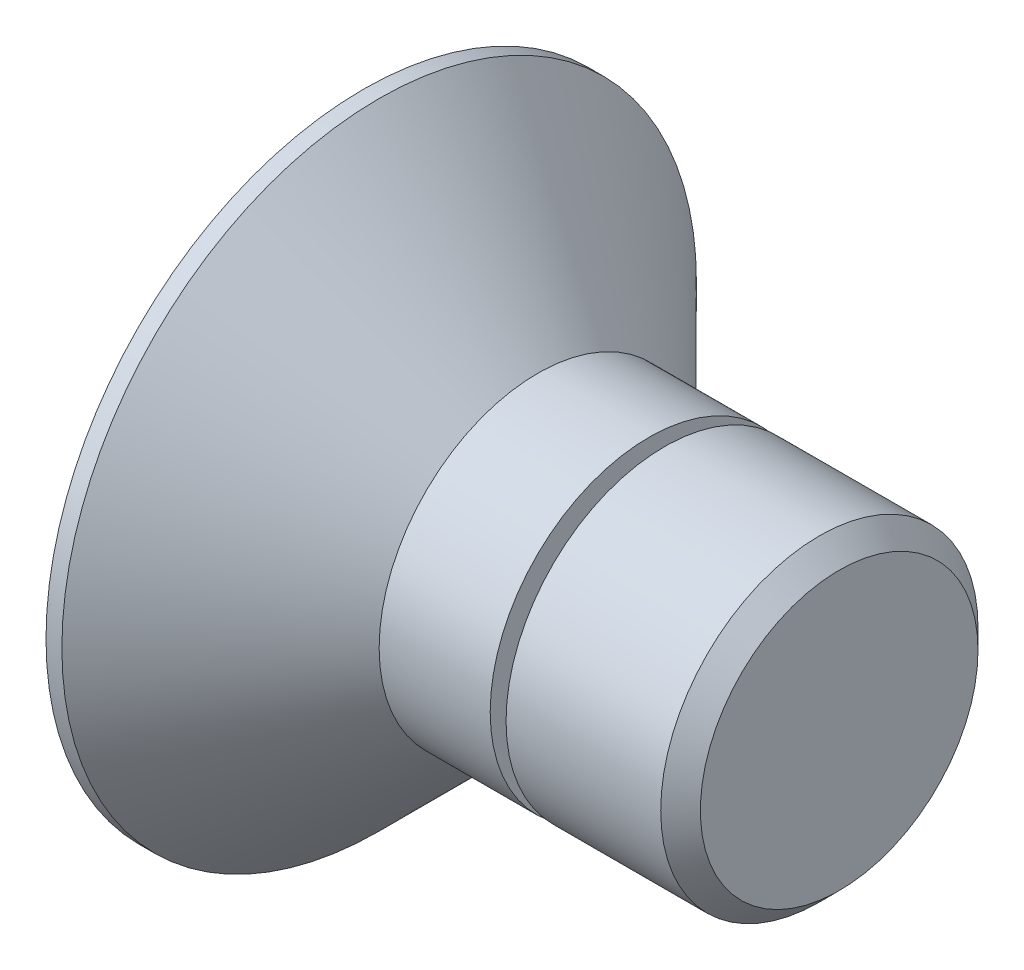
ISO-10303-21;
HEADER;
FILE_DESCRIPTION(('STEP AP214'),'2;1');
FILE_NAME('part.step','',(''),(''),'','','');
FILE_SCHEMA(('AUTOMOTIVE_DESIGN { 1 0 10303 214 1 1 1 1 }'));
ENDSEC;
DATA;
#1=APPLICATION_CONTEXT('core data for automotive mechanical design processes');
#2=APPLICATION_PROTOCOL_DEFINITION('international standard','automotive_design',2000,#1);
#3=PRODUCT_CONTEXT('',#1,'mechanical');
#4=PRODUCT('Part','Part','',(#3));
#5=PRODUCT_RELATED_PRODUCT_CATEGORY('part','',(#4));
#6=PRODUCT_DEFINITION_FORMATION('','',#4);
#7=PRODUCT_DEFINITION_CONTEXT('part definition',#1,'design');
#8=PRODUCT_DEFINITION('design','',#6,#7);
#9=PRODUCT_DEFINITION_SHAPE('','',#8);
#10=(LENGTH_UNIT() NAMED_UNIT(*) SI_UNIT(.MILLI.,.METRE.));
#11=(NAMED_UNIT(*) PLANE_ANGLE_UNIT() SI_UNIT($,.RADIAN.));
#12=(NAMED_UNIT(*) SI_UNIT($,.STERADIAN.) SOLID_ANGLE_UNIT());
#13=UNCERTAINTY_MEASURE_WITH_UNIT(LENGTH_MEASURE(1.E-05),#10,'distance_accuracy_value','');
#14=(GEOMETRIC_REPRESENTATION_CONTEXT(3) GLOBAL_UNCERTAINTY_ASSIGNED_CONTEXT((#13)) GLOBAL_UNIT_ASSIGNED_CONTEXT((#10,
#11,#12)) REPRESENTATION_CONTEXT('',''));
#15=CARTESIAN_POINT('',(0.,0.,0.));
#16=DIRECTION('',(0.,0.,1.));
#17=DIRECTION('',(1.,0.,0.));
#18=AXIS2_PLACEMENT_3D('',#15,#16,#17);
#19=CARTESIAN_POINT('',(-21.9631443298969,0.,0.));
#20=DIRECTION('',(-1.,0.,0.));
#21=DIRECTION('',(0.,0.,1.));
#22=AXIS2_PLACEMENT_3D('',#19,#20,#21);
#23=CYLINDRICAL_SURFACE('',#22,1.99999999999999);
#24=CARTESIAN_POINT('',(5.75,0.,0.));
#25=DIRECTION('',(1.,0.,0.));
#26=DIRECTION('',(0.,0.,-1.));
#27=AXIS2_PLACEMENT_3D('',#24,#25,#26);
#28=CIRCLE('',#27,1.99999999999999);
#29=CARTESIAN_POINT('',(5.75,0.,-1.99999999999999));
#30=VERTEX_POINT('',#29);
#31=EDGE_CURVE('E11',#30,#30,#28,.F.);
#32=ORIENTED_EDGE('',*,*,#31,.T.);
#33=EDGE_LOOP('',(#32));
#34=FACE_BOUND('',#33,.T.);
#35=CARTESIAN_POINT('',(3.8,0.,0.));
#36=DIRECTION('',(-1.,0.,0.));
#37=DIRECTION('',(0.,0.,1.));
#38=AXIS2_PLACEMENT_3D('',#35,#36,#37);
#39=CIRCLE('',#38,1.99999999999999);
#40=CARTESIAN_POINT('',(3.8,0.,1.99999999999999));
#41=VERTEX_POINT('',#40);
#42=EDGE_CURVE('E136',#41,#41,#39,.T.);
#43=ORIENTED_EDGE('',*,*,#42,.F.);
#44=EDGE_LOOP('',(#43));
#45=FACE_BOUND('',#44,.T.);
#46=ADVANCED_FACE('F34',(#34,#45),#23,.T.);
#47=CARTESIAN_POINT('',(0.,4.,0.));
#48=DIRECTION('',(1.,0.,0.));
#49=DIRECTION('',(0.,0.,-1.));
#50=AXIS2_PLACEMENT_3D('',#47,#48,#49);
#51=PLANE('',#50);
#52=DIRECTION('',(0.,0.5,0.866025403784439));
#53=VECTOR('',#52,1.);
#54=CARTESIAN_POINT('',(0.,-1.44337567297406,0.));
#55=LINE('',#54,#53);
#56=CARTESIAN_POINT('',(0.,-1.44337567297406,0.));
#57=VERTEX_POINT('',#56);
#58=CARTESIAN_POINT('',(0.,-0.721687836487032,1.25));
#59=VERTEX_POINT('',#58);
#60=EDGE_CURVE('E123',#57,#59,#55,.T.);
#61=ORIENTED_EDGE('',*,*,#60,.F.);
#62=DIRECTION('',(0.,-0.5,0.866025403784439));
#63=VECTOR('',#62,1.);
#64=CARTESIAN_POINT('',(0.,-0.721687836487032,-1.25));
#65=LINE('',#64,#63);
#66=CARTESIAN_POINT('',(0.,-0.721687836487032,-1.25));
#67=VERTEX_POINT('',#66);
#68=EDGE_CURVE('E49',#67,#57,#65,.T.);
#69=ORIENTED_EDGE('',*,*,#68,.F.);
#70=DIRECTION('',(0.,-1.,0.));
#71=VECTOR('',#70,1.);
#72=CARTESIAN_POINT('',(0.,0.721687836487032,-1.25));
#73=LINE('',#72,#71);
#74=CARTESIAN_POINT('',(0.,0.721687836487032,-1.25));
#75=VERTEX_POINT('',#74);
#76=EDGE_CURVE('E132',#75,#67,#73,.T.);
#77=ORIENTED_EDGE('',*,*,#76,.F.);
#78=DIRECTION('',(0.,-0.5,-0.866025403784439));
#79=VECTOR('',#78,1.);
#80=CARTESIAN_POINT('',(0.,1.44337567297406,0.));
#81=LINE('',#80,#79);
#82=CARTESIAN_POINT('',(0.,1.44337567297406,0.));
#83=VERTEX_POINT('',#82);
#84=EDGE_CURVE('E130',#83,#75,#81,.T.);
#85=ORIENTED_EDGE('',*,*,#84,.F.);
#86=DIRECTION('',(0.,0.5,-0.866025403784439));
#87=VECTOR('',#86,1.);
#88=CARTESIAN_POINT('',(0.,0.721687836487032,1.25));
#89=LINE('',#88,#87);
#90=CARTESIAN_POINT('',(0.,0.721687836487032,1.25));
#91=VERTEX_POINT('',#90);
#92=EDGE_CURVE('E97',#91,#83,#89,.T.);
#93=ORIENTED_EDGE('',*,*,#92,.F.);
#94=DIRECTION('',(0.,1.,0.));
#95=VECTOR('',#94,1.);
#96=CARTESIAN_POINT('',(0.,-0.721687836487032,1.25));
#97=LINE('',#96,#95);
#98=EDGE_CURVE('E126',#59,#91,#97,.T.);
#99=ORIENTED_EDGE('',*,*,#98,.F.);
#100=EDGE_LOOP('',(#61,#69,#77,#85,#93,#99));
#101=FACE_BOUND('',#100,.T.);
#102=CARTESIAN_POINT('',(0.,0.,0.));
#103=DIRECTION('',(-1.,0.,0.));
#104=DIRECTION('',(0.,0.,1.));
#105=AXIS2_PLACEMENT_3D('',#102,#103,#104);
#106=CIRCLE('',#105,4.);
#107=CARTESIAN_POINT('',(0.,0.,4.));
#108=VERTEX_POINT('',#107);
#109=EDGE_CURVE('E159',#108,#108,#106,.T.);
#110=ORIENTED_EDGE('',*,*,#109,.T.);
#111=EDGE_LOOP('',(#110));
#112=FACE_BOUND('',#111,.T.);
#113=ADVANCED_FACE('F174',(#101,#112),#51,.F.);
#114=CARTESIAN_POINT('',(-21.9631443298969,0.,0.));
#115=DIRECTION('',(-1.,0.,0.));
#116=DIRECTION('',(0.,0.,1.));
#117=AXIS2_PLACEMENT_3D('',#114,#115,#116);
#118=CYLINDRICAL_SURFACE('',#117,4.);
#119=ORIENTED_EDGE('',*,*,#109,.F.);
#120=EDGE_LOOP('',(#119));
#121=FACE_BOUND('',#120,.T.);
#122=CARTESIAN_POINT('',(0.199999999999978,0.,0.));
#123=DIRECTION('',(-1.,0.,0.));
#124=DIRECTION('',(0.,0.,1.));
#125=AXIS2_PLACEMENT_3D('',#122,#123,#124);
#126=CIRCLE('',#125,4.);
#127=CARTESIAN_POINT('',(0.199999999999978,0.,4.));
#128=VERTEX_POINT('',#127);
#129=EDGE_CURVE('E156',#128,#128,#126,.T.);
#130=ORIENTED_EDGE('',*,*,#129,.T.);
#131=EDGE_LOOP('',(#130));
#132=FACE_BOUND('',#131,.T.);
#133=ADVANCED_FACE('F180',(#121,#132),#118,.T.);
#134=CARTESIAN_POINT('',(2.2,0.,0.));
#135=DIRECTION('',(-1.,0.,0.));
#136=DIRECTION('',(0.,0.,1.));
#137=AXIS2_PLACEMENT_3D('',#134,#135,#136);
#138=CONICAL_SURFACE('',#137,1.99999999999999,0.785398163397445);
#139=ORIENTED_EDGE('',*,*,#129,.F.);
#140=EDGE_LOOP('',(#139));
#141=FACE_BOUND('',#140,.T.);
#142=CARTESIAN_POINT('',(2.2,0.,0.));
#143=DIRECTION('',(-1.,0.,0.));
#144=DIRECTION('',(0.,0.,1.));
#145=AXIS2_PLACEMENT_3D('',#142,#143,#144);
#146=CIRCLE('',#145,1.99999999999999);
#147=CARTESIAN_POINT('',(2.2,0.,1.99999999999999));
#148=VERTEX_POINT('',#147);
#149=EDGE_CURVE('E153',#148,#148,#146,.T.);
#150=ORIENTED_EDGE('',*,*,#149,.T.);
#151=EDGE_LOOP('',(#150));
#152=FACE_BOUND('',#151,.T.);
#153=ADVANCED_FACE('F202',(#141,#152),#138,.T.);
#154=CARTESIAN_POINT('',(-21.9631443298969,0.,0.));
#155=DIRECTION('',(-1.,0.,0.));
#156=DIRECTION('',(0.,0.,1.));
#157=AXIS2_PLACEMENT_3D('',#154,#155,#156);
#158=CYLINDRICAL_SURFACE('',#157,1.99999999999999);
#159=ORIENTED_EDGE('',*,*,#149,.F.);
#160=EDGE_LOOP('',(#159));
#161=FACE_BOUND('',#160,.T.);
#162=CARTESIAN_POINT('',(3.6,0.,0.));
#163=DIRECTION('',(-1.,0.,0.));
#164=DIRECTION('',(0.,0.,1.));
#165=AXIS2_PLACEMENT_3D('',#162,#163,#164);
#166=CIRCLE('',#165,1.99999999999999);
#167=CARTESIAN_POINT('',(3.6,0.,1.99999999999999));
#168=VERTEX_POINT('',#167);
#169=EDGE_CURVE('E150',#168,#168,#166,.T.);
#170=ORIENTED_EDGE('',*,*,#169,.T.);
#171=EDGE_LOOP('',(#170));
#172=FACE_BOUND('',#171,.T.);
#173=ADVANCED_FACE('F198',(#161,#172),#158,.T.);
#174=CARTESIAN_POINT('',(3.6,1.65,0.));
#175=DIRECTION('',(-1.,0.,0.));
#176=DIRECTION('',(0.,0.,1.));
#177=AXIS2_PLACEMENT_3D('',#174,#175,#176);
#178=PLANE('',#177);
#179=ORIENTED_EDGE('',*,*,#169,.F.);
#180=EDGE_LOOP('',(#179));
#181=FACE_BOUND('',#180,.T.);
#182=CARTESIAN_POINT('',(3.6,0.,0.));
#183=DIRECTION('',(-1.,0.,0.));
#184=DIRECTION('',(0.,0.,1.));
#185=AXIS2_PLACEMENT_3D('',#182,#183,#184);
#186=CIRCLE('',#185,1.65);
#187=CARTESIAN_POINT('',(3.6,0.,1.65));
#188=VERTEX_POINT('',#187);
#189=EDGE_CURVE('E147',#188,#188,#186,.T.);
#190=ORIENTED_EDGE('',*,*,#189,.T.);
#191=EDGE_LOOP('',(#190));
#192=FACE_BOUND('',#191,.T.);
#193=ADVANCED_FACE('F194',(#181,#192),#178,.F.);
#194=CARTESIAN_POINT('',(-21.9631443298969,0.,0.));
#195=DIRECTION('',(-1.,0.,0.));
#196=DIRECTION('',(0.,0.,1.));
#197=AXIS2_PLACEMENT_3D('',#194,#195,#196);
#198=CYLINDRICAL_SURFACE('',#197,1.65);
#199=ORIENTED_EDGE('',*,*,#189,.F.);
#200=EDGE_LOOP('',(#199));
#201=FACE_BOUND('',#200,.T.);
#202=CARTESIAN_POINT('',(3.8,0.,0.));
#203=DIRECTION('',(-1.,0.,0.));
#204=DIRECTION('',(0.,0.,1.));
#205=AXIS2_PLACEMENT_3D('',#202,#203,#204);
#206=CIRCLE('',#205,1.65);
#207=CARTESIAN_POINT('',(3.8,0.,1.65));
#208=VERTEX_POINT('',#207);
#209=EDGE_CURVE('E144',#208,#208,#206,.T.);
#210=ORIENTED_EDGE('',*,*,#209,.T.);
#211=EDGE_LOOP('',(#210));
#212=FACE_BOUND('',#211,.T.);
#213=ADVANCED_FACE('F190',(#201,#212),#198,.T.);
#214=CARTESIAN_POINT('',(3.8,1.99999999999999,0.));
#215=DIRECTION('',(1.,0.,0.));
#216=DIRECTION('',(0.,0.,-1.));
#217=AXIS2_PLACEMENT_3D('',#214,#215,#216);
#218=PLANE('',#217);
#219=ORIENTED_EDGE('',*,*,#209,.F.);
#220=EDGE_LOOP('',(#219));
#221=FACE_BOUND('',#220,.T.);
#222=ORIENTED_EDGE('',*,*,#42,.T.);
#223=EDGE_LOOP('',(#222));
#224=FACE_BOUND('',#223,.T.);
#225=ADVANCED_FACE('F187',(#221,#224),#218,.F.);
#226=CARTESIAN_POINT('',(1.55,-0.721687836487032,-1.25));
#227=DIRECTION('',(0.,-0.866025403784439,-0.5));
#228=DIRECTION('',(0.,0.5,-0.866025403784439));
#229=AXIS2_PLACEMENT_3D('',#226,#227,#228);
#230=PLANE('',#229);
#231=ORIENTED_EDGE('',*,*,#68,.T.);
#232=DIRECTION('',(-1.,0.,0.));
#233=VECTOR('',#232,1.);
#234=CARTESIAN_POINT('',(1.55,-1.44337567297406,0.));
#235=LINE('',#234,#233);
#236=CARTESIAN_POINT('',(1.55,-1.44337567297406,0.));
#237=VERTEX_POINT('',#236);
#238=EDGE_CURVE('E79',#237,#57,#235,.T.);
#239=ORIENTED_EDGE('',*,*,#238,.F.);
#240=DIRECTION('',(0.,-0.5,0.866025403784439));
#241=VECTOR('',#240,1.);
#242=CARTESIAN_POINT('',(1.55,-0.721687836487032,-1.25));
#243=LINE('',#242,#241);
#244=CARTESIAN_POINT('',(1.55,-0.721687836487032,-1.25));
#245=VERTEX_POINT('',#244);
#246=EDGE_CURVE('E134',#245,#237,#243,.T.);
#247=ORIENTED_EDGE('',*,*,#246,.F.);
#248=DIRECTION('',(-1.,0.,0.));
#249=VECTOR('',#248,1.);
#250=CARTESIAN_POINT('',(1.55,-0.721687836487032,-1.25));
#251=LINE('',#250,#249);
#252=EDGE_CURVE('E57',#245,#67,#251,.T.);
#253=ORIENTED_EDGE('',*,*,#252,.T.);
#254=EDGE_LOOP('',(#231,#239,#247,#253));
#255=FACE_BOUND('',#254,.T.);
#256=ADVANCED_FACE('F185',(#255),#230,.F.);
#257=CARTESIAN_POINT('',(1.55,0.721687836487032,-1.25));
#258=DIRECTION('',(0.,0.,-1.));
#259=DIRECTION('',(0.,1.,0.));
#260=AXIS2_PLACEMENT_3D('',#257,#258,#259);
#261=PLANE('',#260);
#262=ORIENTED_EDGE('',*,*,#76,.T.);
#263=ORIENTED_EDGE('',*,*,#252,.F.);
#264=DIRECTION('',(0.,-1.,0.));
#265=VECTOR('',#264,1.);
#266=CARTESIAN_POINT('',(1.55,0.721687836487032,-1.25));
#267=LINE('',#266,#265);
#268=CARTESIAN_POINT('',(1.55,0.721687836487032,-1.25));
#269=VERTEX_POINT('',#268);
#270=EDGE_CURVE('E109',#269,#245,#267,.T.);
#271=ORIENTED_EDGE('',*,*,#270,.F.);
#272=DIRECTION('',(-1.,0.,0.));
#273=VECTOR('',#272,1.);
#274=CARTESIAN_POINT('',(1.55,0.721687836487032,-1.25));
#275=LINE('',#274,#273);
#276=EDGE_CURVE('E101',#269,#75,#275,.T.);
#277=ORIENTED_EDGE('',*,*,#276,.T.);
#278=EDGE_LOOP('',(#262,#263,#271,#277));
#279=FACE_BOUND('',#278,.T.);
#280=ADVANCED_FACE('F254',(#279),#261,.F.);
#281=CARTESIAN_POINT('',(1.55,1.44337567297406,0.));
#282=DIRECTION('',(0.,0.866025403784439,-0.5));
#283=DIRECTION('',(0.,0.5,0.866025403784439));
#284=AXIS2_PLACEMENT_3D('',#281,#282,#283);
#285=PLANE('',#284);
#286=ORIENTED_EDGE('',*,*,#84,.T.);
#287=ORIENTED_EDGE('',*,*,#276,.F.);
#288=DIRECTION('',(0.,-0.5,-0.866025403784439));
#289=VECTOR('',#288,1.);
#290=CARTESIAN_POINT('',(1.55,1.44337567297406,0.));
#291=LINE('',#290,#289);
#292=CARTESIAN_POINT('',(1.55,1.44337567297406,0.));
#293=VERTEX_POINT('',#292);
#294=EDGE_CURVE('E105',#293,#269,#291,.T.);
#295=ORIENTED_EDGE('',*,*,#294,.F.);
#296=DIRECTION('',(-1.,0.,0.));
#297=VECTOR('',#296,1.);
#298=CARTESIAN_POINT('',(1.55,1.44337567297406,0.));
#299=LINE('',#298,#297);
#300=EDGE_CURVE('E90',#293,#83,#299,.T.);
#301=ORIENTED_EDGE('',*,*,#300,.T.);
#302=EDGE_LOOP('',(#286,#287,#295,#301));
#303=FACE_BOUND('',#302,.T.);
#304=ADVANCED_FACE('F106',(#303),#285,.F.);
#305=CARTESIAN_POINT('',(1.55,0.721687836487032,1.25));
#306=DIRECTION('',(0.,0.866025403784438,0.5));
#307=DIRECTION('',(0.,-0.5,0.866025403784438));
#308=AXIS2_PLACEMENT_3D('',#305,#306,#307);
#309=PLANE('',#308);
#310=ORIENTED_EDGE('',*,*,#92,.T.);
#311=ORIENTED_EDGE('',*,*,#300,.F.);
#312=DIRECTION('',(0.,0.5,-0.866025403784439));
#313=VECTOR('',#312,1.);
#314=CARTESIAN_POINT('',(1.55,0.721687836487032,1.25));
#315=LINE('',#314,#313);
#316=CARTESIAN_POINT('',(1.55,0.721687836487032,1.25));
#317=VERTEX_POINT('',#316);
#318=EDGE_CURVE('E94',#317,#293,#315,.T.);
#319=ORIENTED_EDGE('',*,*,#318,.F.);
#320=DIRECTION('',(-1.,0.,0.));
#321=VECTOR('',#320,1.);
#322=CARTESIAN_POINT('',(1.55,0.721687836487032,1.25));
#323=LINE('',#322,#321);
#324=EDGE_CURVE('E102',#317,#91,#323,.T.);
#325=ORIENTED_EDGE('',*,*,#324,.T.);
#326=EDGE_LOOP('',(#310,#311,#319,#325));
#327=FACE_BOUND('',#326,.T.);
#328=ADVANCED_FACE('F92',(#327),#309,.F.);
#329=CARTESIAN_POINT('',(1.55,-0.721687836487032,1.25));
#330=DIRECTION('',(0.,0.,1.));
#331=DIRECTION('',(1.,0.,0.));
#332=AXIS2_PLACEMENT_3D('',#329,#330,#331);
#333=PLANE('',#332);
#334=ORIENTED_EDGE('',*,*,#98,.T.);
#335=ORIENTED_EDGE('',*,*,#324,.F.);
#336=DIRECTION('',(0.,1.,0.));
#337=VECTOR('',#336,1.);
#338=CARTESIAN_POINT('',(1.55,-0.721687836487032,1.25));
#339=LINE('',#338,#337);
#340=CARTESIAN_POINT('',(1.55,-0.721687836487032,1.25));
#341=VERTEX_POINT('',#340);
#342=EDGE_CURVE('E115',#341,#317,#339,.T.);
#343=ORIENTED_EDGE('',*,*,#342,.F.);
#344=DIRECTION('',(-1.,0.,0.));
#345=VECTOR('',#344,1.);
#346=CARTESIAN_POINT('',(1.55,-0.721687836487032,1.25));
#347=LINE('',#346,#345);
#348=EDGE_CURVE('E139',#341,#59,#347,.T.);
#349=ORIENTED_EDGE('',*,*,#348,.T.);
#350=EDGE_LOOP('',(#334,#335,#343,#349));
#351=FACE_BOUND('',#350,.T.);
#352=ADVANCED_FACE('F271',(#351),#333,.F.);
#353=CARTESIAN_POINT('',(1.55,-1.44337567297406,0.));
#354=DIRECTION('',(0.,-0.866025403784439,0.5));
#355=DIRECTION('',(0.,-0.5,-0.866025403784439));
#356=AXIS2_PLACEMENT_3D('',#353,#354,#355);
#357=PLANE('',#356);
#358=ORIENTED_EDGE('',*,*,#60,.T.);
#359=ORIENTED_EDGE('',*,*,#348,.F.);
#360=DIRECTION('',(0.,0.5,0.866025403784439));
#361=VECTOR('',#360,1.);
#362=CARTESIAN_POINT('',(1.55,-1.44337567297406,0.));
#363=LINE('',#362,#361);
#364=EDGE_CURVE('E117',#237,#341,#363,.T.);
#365=ORIENTED_EDGE('',*,*,#364,.F.);
#366=ORIENTED_EDGE('',*,*,#238,.T.);
#367=EDGE_LOOP('',(#358,#359,#365,#366));
#368=FACE_BOUND('',#367,.T.);
#369=ADVANCED_FACE('F278',(#368),#357,.F.);
#370=CARTESIAN_POINT('',(1.55,-2.1650635094611,1.25));
#371=DIRECTION('',(-1.,0.,0.));
#372=DIRECTION('',(0.,0.,1.));
#373=AXIS2_PLACEMENT_3D('',#370,#371,#372);
#374=PLANE('',#373);
#375=ORIENTED_EDGE('',*,*,#246,.T.);
#376=ORIENTED_EDGE('',*,*,#364,.T.);
#377=ORIENTED_EDGE('',*,*,#342,.T.);
#378=ORIENTED_EDGE('',*,*,#318,.T.);
#379=ORIENTED_EDGE('',*,*,#294,.T.);
#380=ORIENTED_EDGE('',*,*,#270,.T.);
#381=EDGE_LOOP('',(#375,#376,#377,#378,#379,#380));
#382=FACE_BOUND('',#381,.T.);
#383=ADVANCED_FACE('F112',(#382),#374,.T.);
#384=CARTESIAN_POINT('',(6.,0.,0.));
#385=DIRECTION('',(1.,0.,0.));
#386=DIRECTION('',(0.,0.,-1.));
#387=AXIS2_PLACEMENT_3D('',#384,#385,#386);
#388=PLANE('',#387);
#389=CARTESIAN_POINT('',(6.,0.,0.));
#390=DIRECTION('',(1.,0.,0.));
#391=DIRECTION('',(0.,0.,-1.));
#392=AXIS2_PLACEMENT_3D('',#389,#390,#391);
#393=CIRCLE('',#392,1.74999999999999);
#394=CARTESIAN_POINT('',(6.,0.,-1.74999999999999));
#395=VERTEX_POINT('',#394);
#396=EDGE_CURVE('E42',#395,#395,#393,.T.);
#397=ORIENTED_EDGE('',*,*,#396,.T.);
#398=EDGE_LOOP('',(#397));
#399=FACE_BOUND('',#398,.T.);
#400=ADVANCED_FACE('F164',(#399),#388,.T.);
#401=CARTESIAN_POINT('',(6.,0.,0.));
#402=DIRECTION('',(-1.,0.,0.));
#403=DIRECTION('',(0.,0.,1.));
#404=AXIS2_PLACEMENT_3D('',#401,#402,#403);
#405=CONICAL_SURFACE('',#404,1.74999999999999,0.785398163397443);
#406=ORIENTED_EDGE('',*,*,#31,.F.);
#407=EDGE_LOOP('',(#406));
#408=FACE_BOUND('',#407,.T.);
#409=ORIENTED_EDGE('',*,*,#396,.F.);
#410=EDGE_LOOP('',(#409));
#411=FACE_BOUND('',#410,.T.);
#412=ADVANCED_FACE('F36',(#408,#411),#405,.T.);
#413=CLOSED_SHELL('',(#46,#113,#133,#153,#173,#193,#213,#225,#256,#280,#304,#328,#352,#369,#383,
#400,#412));
#414=MANIFOLD_SOLID_BREP('B2',#413);
#415=ADVANCED_BREP_SHAPE_REPRESENTATION('',(#18,#414),#14);
#416=SHAPE_DEFINITION_REPRESENTATION(#9,#415);
ENDSEC;
END-ISO-10303-21;
